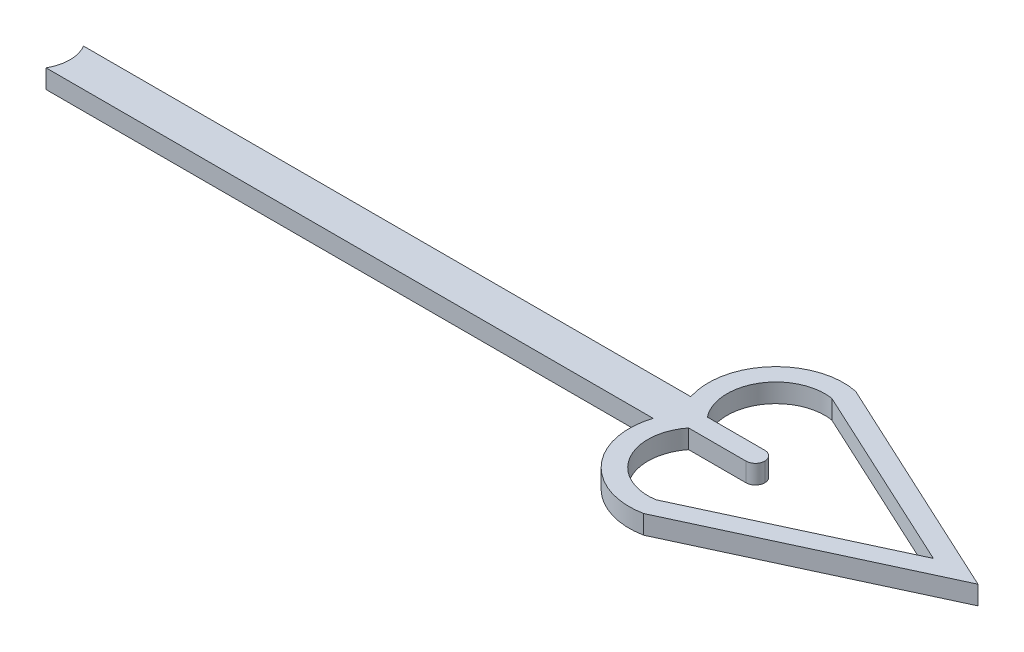
ISO-10303-21;
HEADER;
FILE_DESCRIPTION(('STEP AP214'),'2;1');
FILE_NAME('part.step','',(''),(''),'','','');
FILE_SCHEMA(('AUTOMOTIVE_DESIGN { 1 0 10303 214 1 1 1 1 }'));
ENDSEC;
DATA;
#1=APPLICATION_CONTEXT('core data for automotive mechanical design processes');
#2=APPLICATION_PROTOCOL_DEFINITION('international standard','automotive_design',2000,#1);
#3=PRODUCT_CONTEXT('',#1,'mechanical');
#4=PRODUCT('Part','Part','',(#3));
#5=PRODUCT_RELATED_PRODUCT_CATEGORY('part','',(#4));
#6=PRODUCT_DEFINITION_FORMATION('','',#4);
#7=PRODUCT_DEFINITION_CONTEXT('part definition',#1,'design');
#8=PRODUCT_DEFINITION('design','',#6,#7);
#9=PRODUCT_DEFINITION_SHAPE('','',#8);
#10=(LENGTH_UNIT() NAMED_UNIT(*) SI_UNIT(.MILLI.,.METRE.));
#11=(NAMED_UNIT(*) PLANE_ANGLE_UNIT() SI_UNIT($,.RADIAN.));
#12=(NAMED_UNIT(*) SI_UNIT($,.STERADIAN.) SOLID_ANGLE_UNIT());
#13=UNCERTAINTY_MEASURE_WITH_UNIT(LENGTH_MEASURE(1.E-05),#10,'distance_accuracy_value','');
#14=(GEOMETRIC_REPRESENTATION_CONTEXT(3) GLOBAL_UNCERTAINTY_ASSIGNED_CONTEXT((#13)) GLOBAL_UNIT_ASSIGNED_CONTEXT((#10,
#11,#12)) REPRESENTATION_CONTEXT('',''));
#15=CARTESIAN_POINT('',(0.,0.,0.));
#16=DIRECTION('',(0.,0.,1.));
#17=DIRECTION('',(1.,0.,0.));
#18=AXIS2_PLACEMENT_3D('',#15,#16,#17);
#19=CARTESIAN_POINT('',(68.1362641278125,1.5875,-1.75409841051544));
#20=DIRECTION('',(0.,-1.,0.));
#21=DIRECTION('',(0.,0.,-1.));
#22=AXIS2_PLACEMENT_3D('',#19,#20,#21);
#23=CYLINDRICAL_SURFACE('',#22,4.12749999999999);
#24=CARTESIAN_POINT('',(68.1362641278125,1.5875,-1.75409841051544));
#25=DIRECTION('',(0.,1.,0.));
#26=DIRECTION('',(0.,0.,-1.));
#27=AXIS2_PLACEMENT_3D('',#24,#25,#26);
#28=CIRCLE('',#27,4.12749999999999);
#29=CARTESIAN_POINT('',(68.7681939659993,1.5875,-5.83293659431351));
#30=VERTEX_POINT('',#29);
#31=CARTESIAN_POINT('',(64.8889999366765,1.5875,0.793750000000002));
#32=VERTEX_POINT('',#31);
#33=EDGE_CURVE('E215',#30,#32,#28,.T.);
#34=ORIENTED_EDGE('',*,*,#33,.T.);
#35=DIRECTION('',(0.,1.,0.));
#36=VECTOR('',#35,1.);
#37=CARTESIAN_POINT('',(64.8889999366765,0.,0.79375));
#38=LINE('',#37,#36);
#39=CARTESIAN_POINT('',(64.8889999366765,0.,0.793750000000002));
#40=VERTEX_POINT('',#39);
#41=EDGE_CURVE('E196',#40,#32,#38,.T.);
#42=ORIENTED_EDGE('',*,*,#41,.F.);
#43=CARTESIAN_POINT('',(68.1362641278125,0.,-1.75409841051544));
#44=DIRECTION('',(0.,1.,0.));
#45=DIRECTION('',(0.,0.,-1.));
#46=AXIS2_PLACEMENT_3D('',#43,#44,#45);
#47=CIRCLE('',#46,4.12749999999999);
#48=CARTESIAN_POINT('',(68.7681939659993,0.,-5.83293659431351));
#49=VERTEX_POINT('',#48);
#50=EDGE_CURVE('E192',#49,#40,#47,.T.);
#51=ORIENTED_EDGE('',*,*,#50,.F.);
#52=DIRECTION('',(0.,-1.,0.));
#53=VECTOR('',#52,1.);
#54=CARTESIAN_POINT('',(68.7681939659993,1.5875,-5.83293659431351));
#55=LINE('',#54,#53);
#56=EDGE_CURVE('E217',#30,#49,#55,.T.);
#57=ORIENTED_EDGE('',*,*,#56,.F.);
#58=EDGE_LOOP('',(#34,#42,#51,#57));
#59=FACE_BOUND('',#58,.T.);
#60=ADVANCED_FACE('F33',(#59),#23,.F.);
#61=CARTESIAN_POINT('',(63.5,1.5875,3.17499999999999));
#62=DIRECTION('',(0.,0.,1.));
#63=DIRECTION('',(1.,0.,0.));
#64=AXIS2_PLACEMENT_3D('',#61,#62,#63);
#65=PLANE('',#64);
#66=DIRECTION('',(-1.,0.,0.));
#67=VECTOR('',#66,1.);
#68=CARTESIAN_POINT('',(63.5,1.5875,3.17499999999999));
#69=LINE('',#68,#67);
#70=CARTESIAN_POINT('',(62.6971131126055,1.5875,3.17499999999999));
#71=VERTEX_POINT('',#70);
#72=CARTESIAN_POINT('',(11.43,1.5875,3.17499999999999));
#73=VERTEX_POINT('',#72);
#74=EDGE_CURVE('E156',#71,#73,#69,.T.);
#75=ORIENTED_EDGE('',*,*,#74,.T.);
#76=DIRECTION('',(0.,1.,0.));
#77=VECTOR('',#76,1.);
#78=CARTESIAN_POINT('',(11.43,0.,3.17499999999999));
#79=LINE('',#78,#77);
#80=CARTESIAN_POINT('',(11.43,0.,3.17499999999999));
#81=VERTEX_POINT('',#80);
#82=EDGE_CURVE('E140',#81,#73,#79,.T.);
#83=ORIENTED_EDGE('',*,*,#82,.F.);
#84=DIRECTION('',(-1.,0.,0.));
#85=VECTOR('',#84,1.);
#86=CARTESIAN_POINT('',(63.5,0.,3.17499999999999));
#87=LINE('',#86,#85);
#88=CARTESIAN_POINT('',(62.6971131126055,0.,3.17499999999999));
#89=VERTEX_POINT('',#88);
#90=EDGE_CURVE('E154',#89,#81,#87,.T.);
#91=ORIENTED_EDGE('',*,*,#90,.F.);
#92=DIRECTION('',(0.,-1.,0.));
#93=VECTOR('',#92,1.);
#94=CARTESIAN_POINT('',(62.6971131126055,1.5875,3.17499999999999));
#95=LINE('',#94,#93);
#96=EDGE_CURVE('E166',#89,#71,#95,.F.);
#97=ORIENTED_EDGE('',*,*,#96,.T.);
#98=EDGE_LOOP('',(#75,#83,#91,#97));
#99=FACE_BOUND('',#98,.T.);
#100=ADVANCED_FACE('F152',(#99),#65,.T.);
#101=CARTESIAN_POINT('',(0.,1.5875,0.));
#102=DIRECTION('',(0.,0.,-1.));
#103=DIRECTION('',(-1.,0.,0.));
#104=AXIS2_PLACEMENT_3D('',#101,#102,#103);
#105=PLANE('',#104);
#106=DIRECTION('',(1.,0.,0.));
#107=VECTOR('',#106,1.);
#108=CARTESIAN_POINT('',(0.,0.,0.));
#109=LINE('',#108,#107);
#110=CARTESIAN_POINT('',(11.43,0.,0.));
#111=VERTEX_POINT('',#110);
#112=CARTESIAN_POINT('',(62.6971131126055,0.,0.));
#113=VERTEX_POINT('',#112);
#114=EDGE_CURVE('E163',#111,#113,#109,.T.);
#115=ORIENTED_EDGE('',*,*,#114,.F.);
#116=DIRECTION('',(0.,1.,0.));
#117=VECTOR('',#116,1.);
#118=CARTESIAN_POINT('',(11.43,0.,0.));
#119=LINE('',#118,#117);
#120=CARTESIAN_POINT('',(11.43,1.5875,0.));
#121=VERTEX_POINT('',#120);
#122=EDGE_CURVE('E143',#111,#121,#119,.T.);
#123=ORIENTED_EDGE('',*,*,#122,.T.);
#124=DIRECTION('',(1.,0.,0.));
#125=VECTOR('',#124,1.);
#126=CARTESIAN_POINT('',(0.,1.5875,0.));
#127=LINE('',#126,#125);
#128=CARTESIAN_POINT('',(62.6971131126055,1.5875,0.));
#129=VERTEX_POINT('',#128);
#130=EDGE_CURVE('E162',#121,#129,#127,.T.);
#131=ORIENTED_EDGE('',*,*,#130,.T.);
#132=DIRECTION('',(0.,-1.,0.));
#133=VECTOR('',#132,1.);
#134=CARTESIAN_POINT('',(62.6971131126055,1.5875,0.));
#135=LINE('',#134,#133);
#136=EDGE_CURVE('E257',#129,#113,#135,.T.);
#137=ORIENTED_EDGE('',*,*,#136,.T.);
#138=EDGE_LOOP('',(#115,#123,#131,#137));
#139=FACE_BOUND('',#138,.T.);
#140=ADVANCED_FACE('F266',(#139),#105,.T.);
#141=CARTESIAN_POINT('',(0.,1.5875,0.));
#142=DIRECTION('',(0.,-1.,0.));
#143=DIRECTION('',(0.,0.,-1.));
#144=AXIS2_PLACEMENT_3D('',#141,#142,#143);
#145=PLANE('',#144);
#146=CARTESIAN_POINT('',(69.740091813252,1.5875,1.5875));
#147=DIRECTION('',(0.,-1.,0.));
#148=DIRECTION('',(0.,0.,-1.));
#149=AXIS2_PLACEMENT_3D('',#146,#147,#148);
#150=CIRCLE('',#149,0.79375);
#151=CARTESIAN_POINT('',(69.740091813252,1.5875,2.38125));
#152=VERTEX_POINT('',#151);
#153=CARTESIAN_POINT('',(70.533841813252,1.5875,1.5875));
#154=VERTEX_POINT('',#153);
#155=EDGE_CURVE('E170',#152,#154,#150,.F.);
#156=ORIENTED_EDGE('',*,*,#155,.T.);
#157=CARTESIAN_POINT('',(69.740091813252,1.5875,1.5875));
#158=DIRECTION('',(0.,-1.,0.));
#159=DIRECTION('',(0.,0.,-1.));
#160=AXIS2_PLACEMENT_3D('',#157,#158,#159);
#161=CIRCLE('',#160,0.79375);
#162=CARTESIAN_POINT('',(69.740091813252,1.5875,0.79375));
#163=VERTEX_POINT('',#162);
#164=EDGE_CURVE('E172',#154,#163,#161,.F.);
#165=ORIENTED_EDGE('',*,*,#164,.T.);
#166=DIRECTION('',(1.,0.,0.));
#167=VECTOR('',#166,1.);
#168=CARTESIAN_POINT('',(64.8889999366765,1.5875,0.79375));
#169=LINE('',#168,#167);
#170=EDGE_CURVE('E186',#32,#163,#169,.T.);
#171=ORIENTED_EDGE('',*,*,#170,.F.);
#172=ORIENTED_EDGE('',*,*,#33,.F.);
#173=DIRECTION('',(-0.907137535872881,0.,-0.420834279747358));
#174=VECTOR('',#173,1.);
#175=CARTESIAN_POINT('',(68.7681939659993,1.5875,-5.83293659431352));
#176=LINE('',#175,#174);
#177=CARTESIAN_POINT('',(84.7634607282688,1.5875,1.5875));
#178=VERTEX_POINT('',#177);
#179=EDGE_CURVE('E212',#178,#30,#176,.T.);
#180=ORIENTED_EDGE('',*,*,#179,.F.);
#181=DIRECTION('',(0.907137535872881,0.,-0.420834279747358));
#182=VECTOR('',#181,1.);
#183=CARTESIAN_POINT('',(84.7634607282688,1.5875,1.5875));
#184=LINE('',#183,#182);
#185=CARTESIAN_POINT('',(68.7681939659993,1.5875,9.00793659431353));
#186=VERTEX_POINT('',#185);
#187=EDGE_CURVE('E210',#186,#178,#184,.T.);
#188=ORIENTED_EDGE('',*,*,#187,.F.);
#189=CARTESIAN_POINT('',(68.1362641278125,1.5875,4.92909841051546));
#190=DIRECTION('',(0.,1.,0.));
#191=DIRECTION('',(0.,0.,1.));
#192=AXIS2_PLACEMENT_3D('',#189,#190,#191);
#193=CIRCLE('',#192,4.1275);
#194=CARTESIAN_POINT('',(64.8889999366765,1.5875,2.38125));
#195=VERTEX_POINT('',#194);
#196=EDGE_CURVE('E208',#195,#186,#193,.T.);
#197=ORIENTED_EDGE('',*,*,#196,.F.);
#198=DIRECTION('',(1.,0.,0.));
#199=VECTOR('',#198,1.);
#200=CARTESIAN_POINT('',(64.8889999366765,1.5875,2.38125));
#201=LINE('',#200,#199);
#202=EDGE_CURVE('E200',#195,#152,#201,.T.);
#203=ORIENTED_EDGE('',*,*,#202,.T.);
#204=EDGE_LOOP('',(#156,#165,#171,#172,#180,#188,#197,#203));
#205=FACE_BOUND('',#204,.T.);
#206=CARTESIAN_POINT('',(8.6803693429844,1.5875,1.58749999999999));
#207=DIRECTION('',(0.,-1.,0.));
#208=DIRECTION('',(0.,0.,-1.));
#209=AXIS2_PLACEMENT_3D('',#206,#207,#208);
#210=CIRCLE('',#209,3.175);
#211=EDGE_CURVE('E147',#121,#73,#210,.T.);
#212=ORIENTED_EDGE('',*,*,#211,.T.);
#213=ORIENTED_EDGE('',*,*,#74,.F.);
#214=CARTESIAN_POINT('',(68.1362641278125,1.5875,4.92909841051546));
#215=DIRECTION('',(0.,1.,0.));
#216=DIRECTION('',(0.,0.,1.));
#217=AXIS2_PLACEMENT_3D('',#214,#215,#216);
#218=CIRCLE('',#217,5.715);
#219=CARTESIAN_POINT('',(69.2496386027629,1.5875,10.5345976994753));
#220=VERTEX_POINT('',#219);
#221=EDGE_CURVE('E231',#71,#220,#218,.T.);
#222=ORIENTED_EDGE('',*,*,#221,.T.);
#223=DIRECTION('',(0.90713753587288,0.,-0.420834279747359));
#224=VECTOR('',#223,1.);
#225=CARTESIAN_POINT('',(88.535729472519,1.5875,1.5875));
#226=LINE('',#225,#224);
#227=CARTESIAN_POINT('',(88.535729472519,1.5875,1.5875));
#228=VERTEX_POINT('',#227);
#229=EDGE_CURVE('E233',#220,#228,#226,.T.);
#230=ORIENTED_EDGE('',*,*,#229,.T.);
#231=DIRECTION('',(-0.907137535872881,0.,-0.420834279747358));
#232=VECTOR('',#231,1.);
#233=CARTESIAN_POINT('',(69.2496386027629,1.5875,-7.35959769947524));
#234=LINE('',#233,#232);
#235=CARTESIAN_POINT('',(69.2496386027629,1.5875,-7.35959769947525));
#236=VERTEX_POINT('',#235);
#237=EDGE_CURVE('E236',#228,#236,#234,.T.);
#238=ORIENTED_EDGE('',*,*,#237,.T.);
#239=CARTESIAN_POINT('',(68.1362641278125,1.5875,-1.75409841051544));
#240=DIRECTION('',(0.,1.,0.));
#241=DIRECTION('',(0.,0.,-1.));
#242=AXIS2_PLACEMENT_3D('',#239,#240,#241);
#243=CIRCLE('',#242,5.715);
#244=EDGE_CURVE('E238',#236,#129,#243,.T.);
#245=ORIENTED_EDGE('',*,*,#244,.T.);
#246=ORIENTED_EDGE('',*,*,#130,.F.);
#247=EDGE_LOOP('',(#212,#213,#222,#230,#238,#245,#246));
#248=FACE_BOUND('',#247,.T.);
#249=ADVANCED_FACE('F262',(#205,#248),#145,.F.);
#250=CARTESIAN_POINT('',(0.,0.,0.));
#251=DIRECTION('',(0.,-1.,0.));
#252=DIRECTION('',(0.,0.,-1.));
#253=AXIS2_PLACEMENT_3D('',#250,#251,#252);
#254=PLANE('',#253);
#255=DIRECTION('',(1.,0.,0.));
#256=VECTOR('',#255,1.);
#257=CARTESIAN_POINT('',(64.8889999366765,0.,0.79375));
#258=LINE('',#257,#256);
#259=CARTESIAN_POINT('',(69.740091813252,0.,0.79375));
#260=VERTEX_POINT('',#259);
#261=EDGE_CURVE('E184',#40,#260,#258,.T.);
#262=ORIENTED_EDGE('',*,*,#261,.T.);
#263=CARTESIAN_POINT('',(69.740091813252,0.,1.5875));
#264=DIRECTION('',(0.,-1.,0.));
#265=DIRECTION('',(0.,0.,-1.));
#266=AXIS2_PLACEMENT_3D('',#263,#264,#265);
#267=CIRCLE('',#266,0.79375);
#268=CARTESIAN_POINT('',(70.533841813252,0.,1.5875));
#269=VERTEX_POINT('',#268);
#270=EDGE_CURVE('E42',#260,#269,#267,.T.);
#271=ORIENTED_EDGE('',*,*,#270,.T.);
#272=CARTESIAN_POINT('',(69.740091813252,0.,1.5875));
#273=DIRECTION('',(0.,-1.,0.));
#274=DIRECTION('',(0.,0.,-1.));
#275=AXIS2_PLACEMENT_3D('',#272,#273,#274);
#276=CIRCLE('',#275,0.79375);
#277=CARTESIAN_POINT('',(69.740091813252,0.,2.38125));
#278=VERTEX_POINT('',#277);
#279=EDGE_CURVE('E49',#269,#278,#276,.T.);
#280=ORIENTED_EDGE('',*,*,#279,.T.);
#281=DIRECTION('',(1.,0.,0.));
#282=VECTOR('',#281,1.);
#283=CARTESIAN_POINT('',(64.8889999366765,0.,2.38125));
#284=LINE('',#283,#282);
#285=CARTESIAN_POINT('',(64.8889999366765,0.,2.38125));
#286=VERTEX_POINT('',#285);
#287=EDGE_CURVE('E194',#286,#278,#284,.T.);
#288=ORIENTED_EDGE('',*,*,#287,.F.);
#289=CARTESIAN_POINT('',(68.1362641278125,0.,4.92909841051546));
#290=DIRECTION('',(0.,1.,0.));
#291=DIRECTION('',(0.,0.,1.));
#292=AXIS2_PLACEMENT_3D('',#289,#290,#291);
#293=CIRCLE('',#292,4.1275);
#294=CARTESIAN_POINT('',(68.7681939659993,0.,9.00793659431353));
#295=VERTEX_POINT('',#294);
#296=EDGE_CURVE('E206',#286,#295,#293,.T.);
#297=ORIENTED_EDGE('',*,*,#296,.T.);
#298=DIRECTION('',(0.907137535872881,0.,-0.420834279747358));
#299=VECTOR('',#298,1.);
#300=CARTESIAN_POINT('',(84.7634607282688,0.,1.5875));
#301=LINE('',#300,#299);
#302=CARTESIAN_POINT('',(84.7634607282688,0.,1.5875));
#303=VERTEX_POINT('',#302);
#304=EDGE_CURVE('E219',#295,#303,#301,.T.);
#305=ORIENTED_EDGE('',*,*,#304,.T.);
#306=DIRECTION('',(-0.907137535872881,0.,-0.420834279747358));
#307=VECTOR('',#306,1.);
#308=CARTESIAN_POINT('',(68.7681939659993,0.,-5.83293659431352));
#309=LINE('',#308,#307);
#310=EDGE_CURVE('E222',#303,#49,#309,.T.);
#311=ORIENTED_EDGE('',*,*,#310,.T.);
#312=ORIENTED_EDGE('',*,*,#50,.T.);
#313=EDGE_LOOP('',(#262,#271,#280,#288,#297,#305,#311,#312));
#314=FACE_BOUND('',#313,.T.);
#315=ORIENTED_EDGE('',*,*,#90,.T.);
#316=CARTESIAN_POINT('',(8.6803693429844,0.,1.58749999999999));
#317=DIRECTION('',(0.,-1.,0.));
#318=DIRECTION('',(0.,0.,-1.));
#319=AXIS2_PLACEMENT_3D('',#316,#317,#318);
#320=CIRCLE('',#319,3.175);
#321=EDGE_CURVE('E137',#111,#81,#320,.T.);
#322=ORIENTED_EDGE('',*,*,#321,.F.);
#323=ORIENTED_EDGE('',*,*,#114,.T.);
#324=CARTESIAN_POINT('',(68.1362641278125,0.,-1.75409841051544));
#325=DIRECTION('',(0.,1.,0.));
#326=DIRECTION('',(0.,0.,-1.));
#327=AXIS2_PLACEMENT_3D('',#324,#325,#326);
#328=CIRCLE('',#327,5.715);
#329=CARTESIAN_POINT('',(69.2496386027629,0.,-7.35959769947525));
#330=VERTEX_POINT('',#329);
#331=EDGE_CURVE('E234',#330,#113,#328,.T.);
#332=ORIENTED_EDGE('',*,*,#331,.F.);
#333=DIRECTION('',(-0.907137535872881,0.,-0.420834279747358));
#334=VECTOR('',#333,1.);
#335=CARTESIAN_POINT('',(69.2496386027629,0.,-7.35959769947524));
#336=LINE('',#335,#334);
#337=CARTESIAN_POINT('',(88.535729472519,0.,1.5875));
#338=VERTEX_POINT('',#337);
#339=EDGE_CURVE('E245',#338,#330,#336,.T.);
#340=ORIENTED_EDGE('',*,*,#339,.F.);
#341=DIRECTION('',(0.90713753587288,0.,-0.420834279747359));
#342=VECTOR('',#341,1.);
#343=CARTESIAN_POINT('',(88.535729472519,0.,1.5875));
#344=LINE('',#343,#342);
#345=CARTESIAN_POINT('',(69.2496386027629,0.,10.5345976994753));
#346=VERTEX_POINT('',#345);
#347=EDGE_CURVE('E243',#346,#338,#344,.T.);
#348=ORIENTED_EDGE('',*,*,#347,.F.);
#349=CARTESIAN_POINT('',(68.1362641278125,0.,4.92909841051546));
#350=DIRECTION('',(0.,1.,0.));
#351=DIRECTION('',(0.,0.,1.));
#352=AXIS2_PLACEMENT_3D('',#349,#350,#351);
#353=CIRCLE('',#352,5.715);
#354=EDGE_CURVE('E161',#89,#346,#353,.T.);
#355=ORIENTED_EDGE('',*,*,#354,.F.);
#356=EDGE_LOOP('',(#315,#322,#323,#332,#340,#348,#355));
#357=FACE_BOUND('',#356,.T.);
#358=ADVANCED_FACE('F159',(#314,#357),#254,.T.);
#359=CARTESIAN_POINT('',(68.1362641278125,1.5875,4.92909841051546));
#360=DIRECTION('',(0.,-1.,0.));
#361=DIRECTION('',(0.,0.,-1.));
#362=AXIS2_PLACEMENT_3D('',#359,#360,#361);
#363=CYLINDRICAL_SURFACE('',#362,5.715);
#364=ORIENTED_EDGE('',*,*,#96,.F.);
#365=ORIENTED_EDGE('',*,*,#354,.T.);
#366=DIRECTION('',(0.,-1.,0.));
#367=VECTOR('',#366,1.);
#368=CARTESIAN_POINT('',(69.2496386027629,1.5875,10.5345976994753));
#369=LINE('',#368,#367);
#370=EDGE_CURVE('E254',#220,#346,#369,.T.);
#371=ORIENTED_EDGE('',*,*,#370,.F.);
#372=ORIENTED_EDGE('',*,*,#221,.F.);
#373=EDGE_LOOP('',(#364,#365,#371,#372));
#374=FACE_BOUND('',#373,.T.);
#375=ADVANCED_FACE('F281',(#374),#363,.T.);
#376=CARTESIAN_POINT('',(88.535729472519,1.5875,1.5875));
#377=DIRECTION('',(-0.420834279747359,0.,-0.90713753587288));
#378=DIRECTION('',(-0.90713753587288,0.,0.420834279747359));
#379=AXIS2_PLACEMENT_3D('',#376,#377,#378);
#380=PLANE('',#379);
#381=ORIENTED_EDGE('',*,*,#347,.T.);
#382=DIRECTION('',(0.,-1.,0.));
#383=VECTOR('',#382,1.);
#384=CARTESIAN_POINT('',(88.535729472519,1.5875,1.5875));
#385=LINE('',#384,#383);
#386=EDGE_CURVE('E251',#228,#338,#385,.T.);
#387=ORIENTED_EDGE('',*,*,#386,.F.);
#388=ORIENTED_EDGE('',*,*,#229,.F.);
#389=ORIENTED_EDGE('',*,*,#370,.T.);
#390=EDGE_LOOP('',(#381,#387,#388,#389));
#391=FACE_BOUND('',#390,.T.);
#392=ADVANCED_FACE('F280',(#391),#380,.F.);
#393=CARTESIAN_POINT('',(69.2496386027629,1.5875,-7.35959769947524));
#394=DIRECTION('',(-0.420834279747359,0.,0.907137535872881));
#395=DIRECTION('',(0.907137535872881,0.,0.420834279747359));
#396=AXIS2_PLACEMENT_3D('',#393,#394,#395);
#397=PLANE('',#396);
#398=ORIENTED_EDGE('',*,*,#339,.T.);
#399=DIRECTION('',(0.,-1.,0.));
#400=VECTOR('',#399,1.);
#401=CARTESIAN_POINT('',(69.2496386027629,1.5875,-7.35959769947525));
#402=LINE('',#401,#400);
#403=EDGE_CURVE('E241',#236,#330,#402,.T.);
#404=ORIENTED_EDGE('',*,*,#403,.F.);
#405=ORIENTED_EDGE('',*,*,#237,.F.);
#406=ORIENTED_EDGE('',*,*,#386,.T.);
#407=EDGE_LOOP('',(#398,#404,#405,#406));
#408=FACE_BOUND('',#407,.T.);
#409=ADVANCED_FACE('F276',(#408),#397,.F.);
#410=CARTESIAN_POINT('',(68.1362641278125,1.5875,-1.75409841051544));
#411=DIRECTION('',(0.,-1.,0.));
#412=DIRECTION('',(0.,0.,-1.));
#413=AXIS2_PLACEMENT_3D('',#410,#411,#412);
#414=CYLINDRICAL_SURFACE('',#413,5.715);
#415=ORIENTED_EDGE('',*,*,#136,.F.);
#416=ORIENTED_EDGE('',*,*,#244,.F.);
#417=ORIENTED_EDGE('',*,*,#403,.T.);
#418=ORIENTED_EDGE('',*,*,#331,.T.);
#419=EDGE_LOOP('',(#415,#416,#417,#418));
#420=FACE_BOUND('',#419,.T.);
#421=ADVANCED_FACE('F271',(#420),#414,.T.);
#422=CARTESIAN_POINT('',(68.1362641278125,1.5875,4.92909841051546));
#423=DIRECTION('',(0.,-1.,0.));
#424=DIRECTION('',(0.,0.,-1.));
#425=AXIS2_PLACEMENT_3D('',#422,#423,#424);
#426=CYLINDRICAL_SURFACE('',#425,4.1275);
#427=DIRECTION('',(0.,1.,0.));
#428=VECTOR('',#427,1.);
#429=CARTESIAN_POINT('',(64.8889999366765,0.,2.38125));
#430=LINE('',#429,#428);
#431=EDGE_CURVE('E193',#286,#195,#430,.T.);
#432=ORIENTED_EDGE('',*,*,#431,.T.);
#433=ORIENTED_EDGE('',*,*,#196,.T.);
#434=DIRECTION('',(0.,-1.,0.));
#435=VECTOR('',#434,1.);
#436=CARTESIAN_POINT('',(68.7681939659993,1.5875,9.00793659431353));
#437=LINE('',#436,#435);
#438=EDGE_CURVE('E228',#186,#295,#437,.T.);
#439=ORIENTED_EDGE('',*,*,#438,.T.);
#440=ORIENTED_EDGE('',*,*,#296,.F.);
#441=EDGE_LOOP('',(#432,#433,#439,#440));
#442=FACE_BOUND('',#441,.T.);
#443=ADVANCED_FACE('F308',(#442),#426,.F.);
#444=CARTESIAN_POINT('',(84.7634607282688,1.5875,1.5875));
#445=DIRECTION('',(-0.420834279747358,0.,-0.907137535872881));
#446=DIRECTION('',(-0.907137535872881,0.,0.420834279747358));
#447=AXIS2_PLACEMENT_3D('',#444,#445,#446);
#448=PLANE('',#447);
#449=ORIENTED_EDGE('',*,*,#304,.F.);
#450=ORIENTED_EDGE('',*,*,#438,.F.);
#451=ORIENTED_EDGE('',*,*,#187,.T.);
#452=DIRECTION('',(0.,-1.,0.));
#453=VECTOR('',#452,1.);
#454=CARTESIAN_POINT('',(84.7634607282688,1.5875,1.5875));
#455=LINE('',#454,#453);
#456=EDGE_CURVE('E226',#178,#303,#455,.T.);
#457=ORIENTED_EDGE('',*,*,#456,.T.);
#458=EDGE_LOOP('',(#449,#450,#451,#457));
#459=FACE_BOUND('',#458,.T.);
#460=ADVANCED_FACE('F304',(#459),#448,.T.);
#461=CARTESIAN_POINT('',(68.7681939659993,1.5875,-5.83293659431352));
#462=DIRECTION('',(-0.420834279747358,0.,0.907137535872881));
#463=DIRECTION('',(0.907137535872881,0.,0.420834279747358));
#464=AXIS2_PLACEMENT_3D('',#461,#462,#463);
#465=PLANE('',#464);
#466=ORIENTED_EDGE('',*,*,#310,.F.);
#467=ORIENTED_EDGE('',*,*,#456,.F.);
#468=ORIENTED_EDGE('',*,*,#179,.T.);
#469=ORIENTED_EDGE('',*,*,#56,.T.);
#470=EDGE_LOOP('',(#466,#467,#468,#469));
#471=FACE_BOUND('',#470,.T.);
#472=ADVANCED_FACE('F301',(#471),#465,.T.);
#473=CARTESIAN_POINT('',(8.6803693429844,0.,1.58749999999999));
#474=DIRECTION('',(0.,1.,0.));
#475=DIRECTION('',(0.,0.,1.));
#476=AXIS2_PLACEMENT_3D('',#473,#474,#475);
#477=CYLINDRICAL_SURFACE('',#476,3.175);
#478=ORIENTED_EDGE('',*,*,#211,.F.);
#479=ORIENTED_EDGE('',*,*,#122,.F.);
#480=ORIENTED_EDGE('',*,*,#321,.T.);
#481=ORIENTED_EDGE('',*,*,#82,.T.);
#482=EDGE_LOOP('',(#478,#479,#480,#481));
#483=FACE_BOUND('',#482,.T.);
#484=ADVANCED_FACE('F139',(#483),#477,.F.);
#485=CARTESIAN_POINT('',(64.8889999366765,0.,0.79375));
#486=DIRECTION('',(0.,0.,1.));
#487=DIRECTION('',(1.,0.,0.));
#488=AXIS2_PLACEMENT_3D('',#485,#486,#487);
#489=PLANE('',#488);
#490=ORIENTED_EDGE('',*,*,#170,.T.);
#491=DIRECTION('',(0.,1.,0.));
#492=VECTOR('',#491,1.);
#493=CARTESIAN_POINT('',(69.740091813252,0.,0.79375));
#494=LINE('',#493,#492);
#495=EDGE_CURVE('E174',#163,#260,#494,.F.);
#496=ORIENTED_EDGE('',*,*,#495,.T.);
#497=ORIENTED_EDGE('',*,*,#261,.F.);
#498=ORIENTED_EDGE('',*,*,#41,.T.);
#499=EDGE_LOOP('',(#490,#496,#497,#498));
#500=FACE_BOUND('',#499,.T.);
#501=ADVANCED_FACE('F182',(#500),#489,.F.);
#502=CARTESIAN_POINT('',(64.8889999366765,0.,2.38125));
#503=DIRECTION('',(0.,0.,1.));
#504=DIRECTION('',(1.,0.,0.));
#505=AXIS2_PLACEMENT_3D('',#502,#503,#504);
#506=PLANE('',#505);
#507=ORIENTED_EDGE('',*,*,#287,.T.);
#508=DIRECTION('',(0.,1.,0.));
#509=VECTOR('',#508,1.);
#510=CARTESIAN_POINT('',(69.740091813252,1.5875,2.38125));
#511=LINE('',#510,#509);
#512=EDGE_CURVE('E11',#278,#152,#511,.T.);
#513=ORIENTED_EDGE('',*,*,#512,.T.);
#514=ORIENTED_EDGE('',*,*,#202,.F.);
#515=ORIENTED_EDGE('',*,*,#431,.F.);
#516=EDGE_LOOP('',(#507,#513,#514,#515));
#517=FACE_BOUND('',#516,.T.);
#518=ADVANCED_FACE('F350',(#517),#506,.T.);
#519=CARTESIAN_POINT('',(69.740091813252,0.,1.5875));
#520=DIRECTION('',(0.,-1.,0.));
#521=DIRECTION('',(0.,0.,-1.));
#522=AXIS2_PLACEMENT_3D('',#519,#520,#521);
#523=CYLINDRICAL_SURFACE('',#522,0.79375);
#524=ORIENTED_EDGE('',*,*,#512,.F.);
#525=ORIENTED_EDGE('',*,*,#279,.F.);
#526=DIRECTION('',(0.,1.,0.));
#527=VECTOR('',#526,1.);
#528=CARTESIAN_POINT('',(70.533841813252,0.,1.5875));
#529=LINE('',#528,#527);
#530=EDGE_CURVE('E37',#154,#269,#529,.F.);
#531=ORIENTED_EDGE('',*,*,#530,.F.);
#532=ORIENTED_EDGE('',*,*,#155,.F.);
#533=EDGE_LOOP('',(#524,#525,#531,#532));
#534=FACE_BOUND('',#533,.T.);
#535=ADVANCED_FACE('F35',(#534),#523,.T.);
#536=CARTESIAN_POINT('',(69.740091813252,0.,1.5875));
#537=DIRECTION('',(0.,1.,0.));
#538=DIRECTION('',(0.,0.,1.));
#539=AXIS2_PLACEMENT_3D('',#536,#537,#538);
#540=CYLINDRICAL_SURFACE('',#539,0.79375);
#541=ORIENTED_EDGE('',*,*,#270,.F.);
#542=ORIENTED_EDGE('',*,*,#495,.F.);
#543=ORIENTED_EDGE('',*,*,#164,.F.);
#544=ORIENTED_EDGE('',*,*,#530,.T.);
#545=EDGE_LOOP('',(#541,#542,#543,#544));
#546=FACE_BOUND('',#545,.T.);
#547=ADVANCED_FACE('F364',(#546),#540,.T.);
#548=CLOSED_SHELL('',(#60,#100,#140,#249,#358,#375,#392,#409,#421,#443,#460,#472,#484,#501,#518,
#535,#547));
#549=MANIFOLD_SOLID_BREP('B2',#548);
#550=ADVANCED_BREP_SHAPE_REPRESENTATION('',(#18,#549),#14);
#551=SHAPE_DEFINITION_REPRESENTATION(#9,#550);
ENDSEC;
END-ISO-10303-21;
